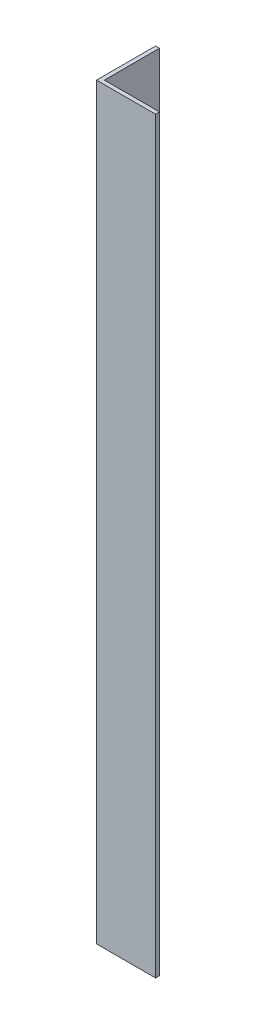
ISO-10303-21;
HEADER;
FILE_DESCRIPTION(('STEP AP214'),'2;1');
FILE_NAME('part.step','',(''),(''),'','','');
FILE_SCHEMA(('AUTOMOTIVE_DESIGN { 1 0 10303 214 1 1 1 1 }'));
ENDSEC;
DATA;
#1=APPLICATION_CONTEXT('core data for automotive mechanical design processes');
#2=APPLICATION_PROTOCOL_DEFINITION('international standard','automotive_design',2000,#1);
#3=PRODUCT_CONTEXT('',#1,'mechanical');
#4=PRODUCT('Part','Part','',(#3));
#5=PRODUCT_RELATED_PRODUCT_CATEGORY('part','',(#4));
#6=PRODUCT_DEFINITION_FORMATION('','',#4);
#7=PRODUCT_DEFINITION_CONTEXT('part definition',#1,'design');
#8=PRODUCT_DEFINITION('design','',#6,#7);
#9=PRODUCT_DEFINITION_SHAPE('','',#8);
#10=(LENGTH_UNIT() NAMED_UNIT(*) SI_UNIT(.MILLI.,.METRE.));
#11=(NAMED_UNIT(*) PLANE_ANGLE_UNIT() SI_UNIT($,.RADIAN.));
#12=(NAMED_UNIT(*) SI_UNIT($,.STERADIAN.) SOLID_ANGLE_UNIT());
#13=UNCERTAINTY_MEASURE_WITH_UNIT(LENGTH_MEASURE(1.E-05),#10,'distance_accuracy_value','');
#14=(GEOMETRIC_REPRESENTATION_CONTEXT(3) GLOBAL_UNCERTAINTY_ASSIGNED_CONTEXT((#13)) GLOBAL_UNIT_ASSIGNED_CONTEXT((#10,
#11,#12)) REPRESENTATION_CONTEXT('',''));
#15=CARTESIAN_POINT('',(0.,0.,0.));
#16=DIRECTION('',(0.,0.,1.));
#17=DIRECTION('',(1.,0.,0.));
#18=AXIS2_PLACEMENT_3D('',#15,#16,#17);
#19=CARTESIAN_POINT('',(15.,190.,0.));
#20=DIRECTION('',(0.,0.,-1.));
#21=DIRECTION('',(-1.,0.,0.));
#22=AXIS2_PLACEMENT_3D('',#19,#20,#21);
#23=PLANE('',#22);
#24=DIRECTION('',(1.,0.,0.));
#25=VECTOR('',#24,1.);
#26=CARTESIAN_POINT('',(15.,0.,0.));
#27=LINE('',#26,#25);
#28=CARTESIAN_POINT('',(0.,0.,0.));
#29=VERTEX_POINT('',#28);
#30=CARTESIAN_POINT('',(15.,0.,0.));
#31=VERTEX_POINT('',#30);
#32=EDGE_CURVE('E119',#29,#31,#27,.T.);
#33=ORIENTED_EDGE('',*,*,#32,.T.);
#34=DIRECTION('',(0.,-1.,0.));
#35=VECTOR('',#34,1.);
#36=CARTESIAN_POINT('',(15.,190.,0.));
#37=LINE('',#36,#35);
#38=CARTESIAN_POINT('',(15.,190.,0.));
#39=VERTEX_POINT('',#38);
#40=EDGE_CURVE('E11',#39,#31,#37,.T.);
#41=ORIENTED_EDGE('',*,*,#40,.F.);
#42=DIRECTION('',(1.,0.,0.));
#43=VECTOR('',#42,1.);
#44=CARTESIAN_POINT('',(15.,190.,0.));
#45=LINE('',#44,#43);
#46=CARTESIAN_POINT('',(0.,190.,0.));
#47=VERTEX_POINT('',#46);
#48=EDGE_CURVE('E129',#47,#39,#45,.T.);
#49=ORIENTED_EDGE('',*,*,#48,.F.);
#50=DIRECTION('',(0.,-1.,0.));
#51=VECTOR('',#50,1.);
#52=CARTESIAN_POINT('',(0.,190.,0.));
#53=LINE('',#52,#51);
#54=EDGE_CURVE('E115',#47,#29,#53,.T.);
#55=ORIENTED_EDGE('',*,*,#54,.T.);
#56=EDGE_LOOP('',(#33,#41,#49,#55));
#57=FACE_BOUND('',#56,.T.);
#58=ADVANCED_FACE('F35',(#57),#23,.F.);
#59=CARTESIAN_POINT('',(15.,190.,-0.999999999999998));
#60=DIRECTION('',(-1.,0.,0.));
#61=DIRECTION('',(0.,0.,1.));
#62=AXIS2_PLACEMENT_3D('',#59,#60,#61);
#63=PLANE('',#62);
#64=DIRECTION('',(0.,0.,-1.));
#65=VECTOR('',#64,1.);
#66=CARTESIAN_POINT('',(15.,0.,-0.999999999999998));
#67=LINE('',#66,#65);
#68=CARTESIAN_POINT('',(15.,0.,-0.999999999999998));
#69=VERTEX_POINT('',#68);
#70=EDGE_CURVE('E122',#31,#69,#67,.T.);
#71=ORIENTED_EDGE('',*,*,#70,.T.);
#72=DIRECTION('',(0.,-1.,0.));
#73=VECTOR('',#72,1.);
#74=CARTESIAN_POINT('',(15.,190.,-0.999999999999998));
#75=LINE('',#74,#73);
#76=CARTESIAN_POINT('',(15.,190.,-0.999999999999998));
#77=VERTEX_POINT('',#76);
#78=EDGE_CURVE('E43',#77,#69,#75,.T.);
#79=ORIENTED_EDGE('',*,*,#78,.F.);
#80=DIRECTION('',(0.,0.,-1.));
#81=VECTOR('',#80,1.);
#82=CARTESIAN_POINT('',(15.,190.,-0.999999999999998));
#83=LINE('',#82,#81);
#84=EDGE_CURVE('E88',#39,#77,#83,.T.);
#85=ORIENTED_EDGE('',*,*,#84,.F.);
#86=ORIENTED_EDGE('',*,*,#40,.T.);
#87=EDGE_LOOP('',(#71,#79,#85,#86));
#88=FACE_BOUND('',#87,.T.);
#89=ADVANCED_FACE('F153',(#88),#63,.F.);
#90=CARTESIAN_POINT('',(1.,190.,-0.999999999999997));
#91=DIRECTION('',(0.,0.,1.));
#92=DIRECTION('',(1.,0.,0.));
#93=AXIS2_PLACEMENT_3D('',#90,#91,#92);
#94=PLANE('',#93);
#95=DIRECTION('',(-1.,0.,0.));
#96=VECTOR('',#95,1.);
#97=CARTESIAN_POINT('',(1.,0.,-0.999999999999997));
#98=LINE('',#97,#96);
#99=CARTESIAN_POINT('',(1.,0.,-0.999999999999997));
#100=VERTEX_POINT('',#99);
#101=EDGE_CURVE('E124',#69,#100,#98,.T.);
#102=ORIENTED_EDGE('',*,*,#101,.T.);
#103=DIRECTION('',(0.,-1.,0.));
#104=VECTOR('',#103,1.);
#105=CARTESIAN_POINT('',(1.,190.,-0.999999999999997));
#106=LINE('',#105,#104);
#107=CARTESIAN_POINT('',(1.,190.,-0.999999999999997));
#108=VERTEX_POINT('',#107);
#109=EDGE_CURVE('E110',#108,#100,#106,.T.);
#110=ORIENTED_EDGE('',*,*,#109,.F.);
#111=DIRECTION('',(-1.,0.,0.));
#112=VECTOR('',#111,1.);
#113=CARTESIAN_POINT('',(1.,190.,-0.999999999999997));
#114=LINE('',#113,#112);
#115=EDGE_CURVE('E101',#77,#108,#114,.T.);
#116=ORIENTED_EDGE('',*,*,#115,.F.);
#117=ORIENTED_EDGE('',*,*,#78,.T.);
#118=EDGE_LOOP('',(#102,#110,#116,#117));
#119=FACE_BOUND('',#118,.T.);
#120=ADVANCED_FACE('F135',(#119),#94,.F.);
#121=CARTESIAN_POINT('',(0.999999999999998,190.,-15.));
#122=DIRECTION('',(-1.,0.,0.));
#123=DIRECTION('',(0.,0.,1.));
#124=AXIS2_PLACEMENT_3D('',#121,#122,#123);
#125=PLANE('',#124);
#126=DIRECTION('',(0.,0.,-1.));
#127=VECTOR('',#126,1.);
#128=CARTESIAN_POINT('',(0.999999999999998,0.,-15.));
#129=LINE('',#128,#127);
#130=CARTESIAN_POINT('',(0.999999999999998,0.,-15.));
#131=VERTEX_POINT('',#130);
#132=EDGE_CURVE('E109',#100,#131,#129,.T.);
#133=ORIENTED_EDGE('',*,*,#132,.T.);
#134=DIRECTION('',(0.,-1.,0.));
#135=VECTOR('',#134,1.);
#136=CARTESIAN_POINT('',(0.999999999999998,190.,-15.));
#137=LINE('',#136,#135);
#138=CARTESIAN_POINT('',(0.999999999999998,190.,-15.));
#139=VERTEX_POINT('',#138);
#140=EDGE_CURVE('E106',#139,#131,#137,.T.);
#141=ORIENTED_EDGE('',*,*,#140,.F.);
#142=DIRECTION('',(0.,0.,-1.));
#143=VECTOR('',#142,1.);
#144=CARTESIAN_POINT('',(0.999999999999998,190.,-15.));
#145=LINE('',#144,#143);
#146=EDGE_CURVE('E95',#108,#139,#145,.T.);
#147=ORIENTED_EDGE('',*,*,#146,.F.);
#148=ORIENTED_EDGE('',*,*,#109,.T.);
#149=EDGE_LOOP('',(#133,#141,#147,#148));
#150=FACE_BOUND('',#149,.T.);
#151=ADVANCED_FACE('F107',(#150),#125,.F.);
#152=CARTESIAN_POINT('',(0.,190.,-15.));
#153=DIRECTION('',(0.,0.,1.));
#154=DIRECTION('',(1.,0.,0.));
#155=AXIS2_PLACEMENT_3D('',#152,#153,#154);
#156=PLANE('',#155);
#157=DIRECTION('',(-1.,0.,0.));
#158=VECTOR('',#157,1.);
#159=CARTESIAN_POINT('',(0.,0.,-15.));
#160=LINE('',#159,#158);
#161=CARTESIAN_POINT('',(0.,0.,-15.));
#162=VERTEX_POINT('',#161);
#163=EDGE_CURVE('E74',#131,#162,#160,.T.);
#164=ORIENTED_EDGE('',*,*,#163,.T.);
#165=DIRECTION('',(0.,-1.,0.));
#166=VECTOR('',#165,1.);
#167=CARTESIAN_POINT('',(0.,190.,-15.));
#168=LINE('',#167,#166);
#169=CARTESIAN_POINT('',(0.,190.,-15.));
#170=VERTEX_POINT('',#169);
#171=EDGE_CURVE('E111',#170,#162,#168,.T.);
#172=ORIENTED_EDGE('',*,*,#171,.F.);
#173=DIRECTION('',(-1.,0.,0.));
#174=VECTOR('',#173,1.);
#175=CARTESIAN_POINT('',(0.,190.,-15.));
#176=LINE('',#175,#174);
#177=EDGE_CURVE('E99',#139,#170,#176,.T.);
#178=ORIENTED_EDGE('',*,*,#177,.F.);
#179=ORIENTED_EDGE('',*,*,#140,.T.);
#180=EDGE_LOOP('',(#164,#172,#178,#179));
#181=FACE_BOUND('',#180,.T.);
#182=ADVANCED_FACE('F113',(#181),#156,.F.);
#183=CARTESIAN_POINT('',(0.,190.,0.));
#184=DIRECTION('',(1.,0.,0.));
#185=DIRECTION('',(0.,0.,-1.));
#186=AXIS2_PLACEMENT_3D('',#183,#184,#185);
#187=PLANE('',#186);
#188=DIRECTION('',(0.,0.,1.));
#189=VECTOR('',#188,1.);
#190=CARTESIAN_POINT('',(0.,0.,0.));
#191=LINE('',#190,#189);
#192=EDGE_CURVE('E80',#162,#29,#191,.T.);
#193=ORIENTED_EDGE('',*,*,#192,.T.);
#194=ORIENTED_EDGE('',*,*,#54,.F.);
#195=DIRECTION('',(0.,0.,1.));
#196=VECTOR('',#195,1.);
#197=CARTESIAN_POINT('',(0.,190.,0.));
#198=LINE('',#197,#196);
#199=EDGE_CURVE('E51',#170,#47,#198,.T.);
#200=ORIENTED_EDGE('',*,*,#199,.F.);
#201=ORIENTED_EDGE('',*,*,#171,.T.);
#202=EDGE_LOOP('',(#193,#194,#200,#201));
#203=FACE_BOUND('',#202,.T.);
#204=ADVANCED_FACE('F142',(#203),#187,.F.);
#205=CARTESIAN_POINT('',(0.,190.,0.));
#206=DIRECTION('',(0.,-1.,0.));
#207=DIRECTION('',(0.,0.,-1.));
#208=AXIS2_PLACEMENT_3D('',#205,#206,#207);
#209=PLANE('',#208);
#210=ORIENTED_EDGE('',*,*,#48,.T.);
#211=ORIENTED_EDGE('',*,*,#84,.T.);
#212=ORIENTED_EDGE('',*,*,#115,.T.);
#213=ORIENTED_EDGE('',*,*,#146,.T.);
#214=ORIENTED_EDGE('',*,*,#177,.T.);
#215=ORIENTED_EDGE('',*,*,#199,.T.);
#216=EDGE_LOOP('',(#210,#211,#212,#213,#214,#215));
#217=FACE_BOUND('',#216,.T.);
#218=ADVANCED_FACE('F97',(#217),#209,.F.);
#219=CARTESIAN_POINT('',(0.,0.,0.));
#220=DIRECTION('',(0.,-1.,0.));
#221=DIRECTION('',(0.,0.,-1.));
#222=AXIS2_PLACEMENT_3D('',#219,#220,#221);
#223=PLANE('',#222);
#224=ORIENTED_EDGE('',*,*,#32,.F.);
#225=ORIENTED_EDGE('',*,*,#192,.F.);
#226=ORIENTED_EDGE('',*,*,#163,.F.);
#227=ORIENTED_EDGE('',*,*,#132,.F.);
#228=ORIENTED_EDGE('',*,*,#101,.F.);
#229=ORIENTED_EDGE('',*,*,#70,.F.);
#230=EDGE_LOOP('',(#224,#225,#226,#227,#228,#229));
#231=FACE_BOUND('',#230,.T.);
#232=ADVANCED_FACE('F138',(#231),#223,.T.);
#233=CLOSED_SHELL('',(#58,#89,#120,#151,#182,#204,#218,#232));
#234=MANIFOLD_SOLID_BREP('B2',#233);
#235=ADVANCED_BREP_SHAPE_REPRESENTATION('',(#18,#234),#14);
#236=SHAPE_DEFINITION_REPRESENTATION(#9,#235);
ENDSEC;
END-ISO-10303-21;
